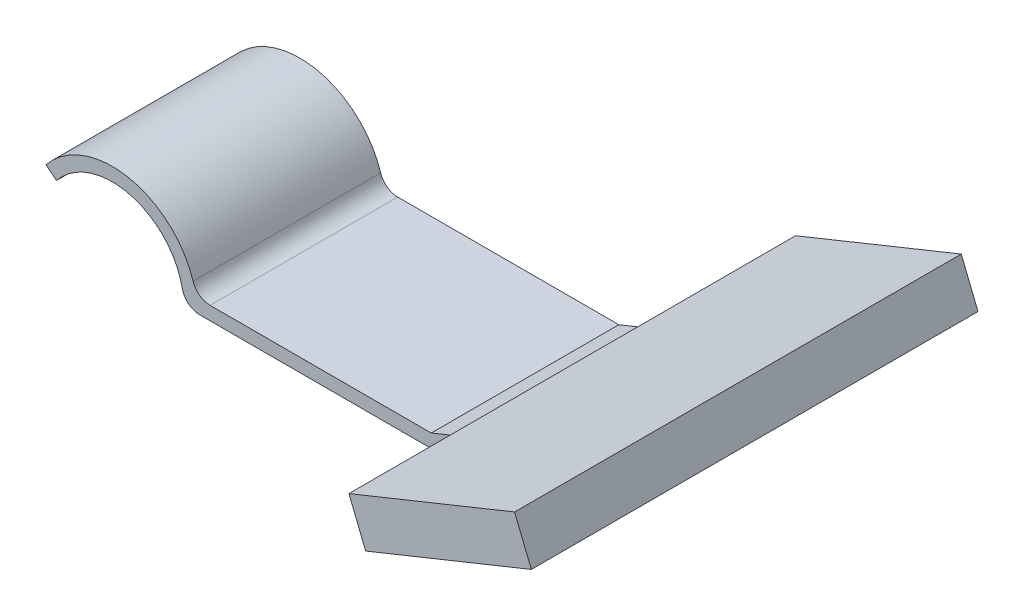
ISO-10303-21;
HEADER;
FILE_DESCRIPTION(('STEP AP214'),'2;1');
FILE_NAME('part.step','',(''),(''),'','','');
FILE_SCHEMA(('AUTOMOTIVE_DESIGN { 1 0 10303 214 1 1 1 1 }'));
ENDSEC;
DATA;
#1=APPLICATION_CONTEXT('core data for automotive mechanical design processes');
#2=APPLICATION_PROTOCOL_DEFINITION('international standard','automotive_design',2000,#1);
#3=PRODUCT_CONTEXT('',#1,'mechanical');
#4=PRODUCT('Part','Part','',(#3));
#5=PRODUCT_RELATED_PRODUCT_CATEGORY('part','',(#4));
#6=PRODUCT_DEFINITION_FORMATION('','',#4);
#7=PRODUCT_DEFINITION_CONTEXT('part definition',#1,'design');
#8=PRODUCT_DEFINITION('design','',#6,#7);
#9=PRODUCT_DEFINITION_SHAPE('','',#8);
#10=(LENGTH_UNIT() NAMED_UNIT(*) SI_UNIT(.MILLI.,.METRE.));
#11=(NAMED_UNIT(*) PLANE_ANGLE_UNIT() SI_UNIT($,.RADIAN.));
#12=(NAMED_UNIT(*) SI_UNIT($,.STERADIAN.) SOLID_ANGLE_UNIT());
#13=UNCERTAINTY_MEASURE_WITH_UNIT(LENGTH_MEASURE(1.E-05),#10,'distance_accuracy_value','');
#14=(GEOMETRIC_REPRESENTATION_CONTEXT(3) GLOBAL_UNCERTAINTY_ASSIGNED_CONTEXT((#13)) GLOBAL_UNIT_ASSIGNED_CONTEXT((#10,
#11,#12)) REPRESENTATION_CONTEXT('',''));
#15=CARTESIAN_POINT('',(0.,0.,0.));
#16=DIRECTION('',(0.,0.,1.));
#17=DIRECTION('',(1.,0.,0.));
#18=AXIS2_PLACEMENT_3D('',#15,#16,#17);
#19=CARTESIAN_POINT('',(28.,0.,10.5));
#20=DIRECTION('',(0.374552819216062,-0.927205578939914,0.));
#21=DIRECTION('',(0.927205578939914,0.374552819216062,0.));
#22=AXIS2_PLACEMENT_3D('',#19,#20,#21);
#23=PLANE('',#22);
#24=DIRECTION('',(-0.927205578939914,-0.374552819216062,0.));
#25=VECTOR('',#24,1.);
#26=CARTESIAN_POINT('',(28.,0.,-10.5));
#27=LINE('',#26,#25);
#28=CARTESIAN_POINT('',(34.2108904228034,2.5089436156788,-10.5));
#29=VERTEX_POINT('',#28);
#30=CARTESIAN_POINT('',(28.,0.,-10.5));
#31=VERTEX_POINT('',#30);
#32=EDGE_CURVE('E216',#29,#31,#27,.T.);
#33=ORIENTED_EDGE('',*,*,#32,.F.);
#34=DIRECTION('',(0.,0.,1.));
#35=VECTOR('',#34,1.);
#36=CARTESIAN_POINT('',(34.2108904228034,2.5089436156788,10.5));
#37=LINE('',#36,#35);
#38=CARTESIAN_POINT('',(34.2108904228034,2.5089436156788,10.5));
#39=VERTEX_POINT('',#38);
#40=EDGE_CURVE('E61',#29,#39,#37,.T.);
#41=ORIENTED_EDGE('',*,*,#40,.T.);
#42=DIRECTION('',(-0.927205578939914,-0.374552819216062,0.));
#43=VECTOR('',#42,1.);
#44=CARTESIAN_POINT('',(28.,0.,10.5));
#45=LINE('',#44,#43);
#46=CARTESIAN_POINT('',(28.,0.,10.5));
#47=VERTEX_POINT('',#46);
#48=EDGE_CURVE('E199',#39,#47,#45,.T.);
#49=ORIENTED_EDGE('',*,*,#48,.T.);
#50=DIRECTION('',(0.,0.,-1.));
#51=VECTOR('',#50,1.);
#52=CARTESIAN_POINT('',(28.,0.,10.5));
#53=LINE('',#52,#51);
#54=EDGE_CURVE('E224',#47,#31,#53,.T.);
#55=ORIENTED_EDGE('',*,*,#54,.T.);
#56=EDGE_LOOP('',(#33,#41,#49,#55));
#57=FACE_BOUND('',#56,.T.);
#58=ADVANCED_FACE('F38',(#57),#23,.T.);
#59=CARTESIAN_POINT('',(27.4381707711759,1.39080836840987,10.5));
#60=DIRECTION('',(0.374552819216062,-0.927205578939913,0.));
#61=DIRECTION('',(0.927205578939914,0.374552819216062,0.));
#62=AXIS2_PLACEMENT_3D('',#59,#60,#61);
#63=PLANE('',#62);
#64=DIRECTION('',(0.,0.,1.));
#65=VECTOR('',#64,1.);
#66=CARTESIAN_POINT('',(33.6490611939793,3.89975198408867,10.5));
#67=LINE('',#66,#65);
#68=CARTESIAN_POINT('',(33.6490611939793,3.89975198408867,-10.5));
#69=VERTEX_POINT('',#68);
#70=CARTESIAN_POINT('',(33.6490611939793,3.89975198408867,10.5));
#71=VERTEX_POINT('',#70);
#72=EDGE_CURVE('E179',#69,#71,#67,.T.);
#73=ORIENTED_EDGE('',*,*,#72,.F.);
#74=DIRECTION('',(-0.927205578939914,-0.374552819216062,0.));
#75=VECTOR('',#74,1.);
#76=CARTESIAN_POINT('',(27.4381707711759,1.39080836840987,-10.5));
#77=LINE('',#76,#75);
#78=CARTESIAN_POINT('',(27.7084746770331,1.5,-10.5));
#79=VERTEX_POINT('',#78);
#80=EDGE_CURVE('E218',#69,#79,#77,.T.);
#81=ORIENTED_EDGE('',*,*,#80,.T.);
#82=DIRECTION('',(0.,0.,-1.));
#83=VECTOR('',#82,1.);
#84=CARTESIAN_POINT('',(27.7084746770331,1.5,10.5));
#85=LINE('',#84,#83);
#86=CARTESIAN_POINT('',(27.7084746770331,1.5,10.5));
#87=VERTEX_POINT('',#86);
#88=EDGE_CURVE('E206',#87,#79,#85,.T.);
#89=ORIENTED_EDGE('',*,*,#88,.F.);
#90=DIRECTION('',(-0.927205578939914,-0.374552819216062,0.));
#91=VECTOR('',#90,1.);
#92=CARTESIAN_POINT('',(27.4381707711759,1.39080836840987,10.5));
#93=LINE('',#92,#91);
#94=EDGE_CURVE('E201',#71,#87,#93,.T.);
#95=ORIENTED_EDGE('',*,*,#94,.F.);
#96=EDGE_LOOP('',(#73,#81,#89,#95));
#97=FACE_BOUND('',#96,.T.);
#98=ADVANCED_FACE('F268',(#97),#63,.F.);
#99=CARTESIAN_POINT('',(-8.,0.,10.5));
#100=DIRECTION('',(0.,0.,1.));
#101=DIRECTION('',(1.,0.,0.));
#102=AXIS2_PLACEMENT_3D('',#99,#100,#101);
#103=PLANE('',#102);
#104=ORIENTED_EDGE('',*,*,#48,.F.);
#105=DIRECTION('',(-0.374552819216062,0.927205578939913,0.));
#106=VECTOR('',#105,1.);
#107=CARTESIAN_POINT('',(29.1604571050262,15.0112923047318,10.5));
#108=LINE('',#107,#106);
#109=EDGE_CURVE('E53',#39,#71,#108,.T.);
#110=ORIENTED_EDGE('',*,*,#109,.T.);
#111=ORIENTED_EDGE('',*,*,#94,.T.);
#112=DIRECTION('',(1.,0.,0.));
#113=VECTOR('',#112,1.);
#114=CARTESIAN_POINT('',(0.,1.5,10.5));
#115=LINE('',#114,#113);
#116=CARTESIAN_POINT('',(2.95445115010332,1.5,10.5));
#117=VERTEX_POINT('',#116);
#118=EDGE_CURVE('E203',#87,#117,#115,.F.);
#119=ORIENTED_EDGE('',*,*,#118,.T.);
#120=CARTESIAN_POINT('',(2.95445115010332,3.5,10.5));
#121=DIRECTION('',(0.,0.,1.));
#122=DIRECTION('',(1.,0.,0.));
#123=AXIS2_PLACEMENT_3D('',#120,#121,#122);
#124=CIRCLE('',#123,2.);
#125=CARTESIAN_POINT('',(1.04932921095492,2.89130434782609,10.5));
#126=VERTEX_POINT('',#125);
#127=EDGE_CURVE('E46',#117,#126,#124,.F.);
#128=ORIENTED_EDGE('',*,*,#127,.T.);
#129=CARTESIAN_POINT('',(-8.,0.,10.5));
#130=DIRECTION('',(0.,0.,1.));
#131=DIRECTION('',(1.,0.,0.));
#132=AXIS2_PLACEMENT_3D('',#129,#130,#131);
#133=CIRCLE('',#132,9.5);
#134=CARTESIAN_POINT('',(-15.4159351230981,5.9375,10.5));
#135=VERTEX_POINT('',#134);
#136=EDGE_CURVE('E188',#126,#135,#133,.T.);
#137=ORIENTED_EDGE('',*,*,#136,.T.);
#138=DIRECTION('',(-0.7806247497998,0.625,0.));
#139=VECTOR('',#138,1.);
#140=CARTESIAN_POINT('',(-14.2449979983984,5.,10.5));
#141=LINE('',#140,#139);
#142=CARTESIAN_POINT('',(-14.2449979983984,5.,10.5));
#143=VERTEX_POINT('',#142);
#144=EDGE_CURVE('E190',#143,#135,#141,.T.);
#145=ORIENTED_EDGE('',*,*,#144,.F.);
#146=CARTESIAN_POINT('',(-8.,0.,10.5));
#147=DIRECTION('',(0.,0.,1.));
#148=DIRECTION('',(1.,0.,0.));
#149=AXIS2_PLACEMENT_3D('',#146,#147,#148);
#150=CIRCLE('',#149,8.);
#151=CARTESIAN_POINT('',(-0.161632823093828,1.6,10.5));
#152=VERTEX_POINT('',#151);
#153=EDGE_CURVE('E194',#152,#143,#150,.T.);
#154=ORIENTED_EDGE('',*,*,#153,.F.);
#155=CARTESIAN_POINT('',(1.79795897113271,2.,10.5));
#156=DIRECTION('',(0.,0.,1.));
#157=DIRECTION('',(1.,0.,0.));
#158=AXIS2_PLACEMENT_3D('',#155,#156,#157);
#159=CIRCLE('',#158,2.);
#160=CARTESIAN_POINT('',(1.79795897113271,0.,10.5));
#161=VERTEX_POINT('',#160);
#162=EDGE_CURVE('E240',#152,#161,#159,.T.);
#163=ORIENTED_EDGE('',*,*,#162,.T.);
#164=DIRECTION('',(-1.,0.,0.));
#165=VECTOR('',#164,1.);
#166=CARTESIAN_POINT('',(0.,0.,10.5));
#167=LINE('',#166,#165);
#168=EDGE_CURVE('E196',#47,#161,#167,.T.);
#169=ORIENTED_EDGE('',*,*,#168,.F.);
#170=EDGE_LOOP('',(#104,#110,#111,#119,#128,#137,#145,#154,#163,#169));
#171=FACE_BOUND('',#170,.T.);
#172=ADVANCED_FACE('F250',(#171),#103,.T.);
#173=CARTESIAN_POINT('',(-8.,0.,-10.5));
#174=DIRECTION('',(0.,0.,1.));
#175=DIRECTION('',(1.,0.,0.));
#176=AXIS2_PLACEMENT_3D('',#173,#174,#175);
#177=PLANE('',#176);
#178=DIRECTION('',(-0.374552819216062,0.927205578939913,0.));
#179=VECTOR('',#178,1.);
#180=CARTESIAN_POINT('',(29.1604571050262,15.0112923047318,-10.5));
#181=LINE('',#180,#179);
#182=EDGE_CURVE('E11',#29,#69,#181,.T.);
#183=ORIENTED_EDGE('',*,*,#182,.F.);
#184=ORIENTED_EDGE('',*,*,#32,.T.);
#185=DIRECTION('',(-1.,0.,0.));
#186=VECTOR('',#185,1.);
#187=CARTESIAN_POINT('',(0.,0.,-10.5));
#188=LINE('',#187,#186);
#189=CARTESIAN_POINT('',(1.79795897113271,0.,-10.5));
#190=VERTEX_POINT('',#189);
#191=EDGE_CURVE('E213',#31,#190,#188,.T.);
#192=ORIENTED_EDGE('',*,*,#191,.T.);
#193=CARTESIAN_POINT('',(1.79795897113271,2.,-10.5));
#194=DIRECTION('',(0.,0.,1.));
#195=DIRECTION('',(1.,0.,0.));
#196=AXIS2_PLACEMENT_3D('',#193,#194,#195);
#197=CIRCLE('',#196,2.);
#198=CARTESIAN_POINT('',(-0.161632823093828,1.6,-10.5));
#199=VERTEX_POINT('',#198);
#200=EDGE_CURVE('E236',#190,#199,#197,.F.);
#201=ORIENTED_EDGE('',*,*,#200,.T.);
#202=CARTESIAN_POINT('',(-8.,0.,-10.5));
#203=DIRECTION('',(0.,0.,1.));
#204=DIRECTION('',(1.,0.,0.));
#205=AXIS2_PLACEMENT_3D('',#202,#203,#204);
#206=CIRCLE('',#205,8.);
#207=CARTESIAN_POINT('',(-14.2449979983984,5.,-10.5));
#208=VERTEX_POINT('',#207);
#209=EDGE_CURVE('E211',#199,#208,#206,.T.);
#210=ORIENTED_EDGE('',*,*,#209,.T.);
#211=DIRECTION('',(-0.7806247497998,0.625,0.));
#212=VECTOR('',#211,1.);
#213=CARTESIAN_POINT('',(-14.2449979983984,5.,-10.5));
#214=LINE('',#213,#212);
#215=CARTESIAN_POINT('',(-15.4159351230981,5.9375,-10.5));
#216=VERTEX_POINT('',#215);
#217=EDGE_CURVE('E208',#208,#216,#214,.T.);
#218=ORIENTED_EDGE('',*,*,#217,.T.);
#219=CARTESIAN_POINT('',(-8.,0.,-10.5));
#220=DIRECTION('',(0.,0.,1.));
#221=DIRECTION('',(1.,0.,0.));
#222=AXIS2_PLACEMENT_3D('',#219,#220,#221);
#223=CIRCLE('',#222,9.5);
#224=CARTESIAN_POINT('',(1.04932921095492,2.89130434782609,-10.5));
#225=VERTEX_POINT('',#224);
#226=EDGE_CURVE('E187',#225,#216,#223,.T.);
#227=ORIENTED_EDGE('',*,*,#226,.F.);
#228=CARTESIAN_POINT('',(2.95445115010332,3.5,-10.5));
#229=DIRECTION('',(0.,0.,1.));
#230=DIRECTION('',(1.,0.,0.));
#231=AXIS2_PLACEMENT_3D('',#228,#229,#230);
#232=CIRCLE('',#231,2.);
#233=CARTESIAN_POINT('',(2.95445115010332,1.5,-10.5));
#234=VERTEX_POINT('',#233);
#235=EDGE_CURVE('E247',#225,#234,#232,.T.);
#236=ORIENTED_EDGE('',*,*,#235,.T.);
#237=DIRECTION('',(1.,0.,0.));
#238=VECTOR('',#237,1.);
#239=CARTESIAN_POINT('',(0.,1.5,-10.5));
#240=LINE('',#239,#238);
#241=EDGE_CURVE('E191',#79,#234,#240,.F.);
#242=ORIENTED_EDGE('',*,*,#241,.F.);
#243=ORIENTED_EDGE('',*,*,#80,.F.);
#244=EDGE_LOOP('',(#183,#184,#192,#201,#210,#218,#227,#236,#242,#243));
#245=FACE_BOUND('',#244,.T.);
#246=ADVANCED_FACE('F262',(#245),#177,.F.);
#247=CARTESIAN_POINT('',(-8.,0.,10.5));
#248=DIRECTION('',(0.,0.,-1.));
#249=DIRECTION('',(-1.,0.,0.));
#250=AXIS2_PLACEMENT_3D('',#247,#248,#249);
#251=CYLINDRICAL_SURFACE('',#250,9.5);
#252=ORIENTED_EDGE('',*,*,#136,.F.);
#253=DIRECTION('',(0.,0.,-1.));
#254=VECTOR('',#253,1.);
#255=CARTESIAN_POINT('',(1.04932921095492,2.89130434782609,10.5));
#256=LINE('',#255,#254);
#257=EDGE_CURVE('E242',#126,#225,#256,.T.);
#258=ORIENTED_EDGE('',*,*,#257,.T.);
#259=ORIENTED_EDGE('',*,*,#226,.T.);
#260=DIRECTION('',(0.,0.,-1.));
#261=VECTOR('',#260,1.);
#262=CARTESIAN_POINT('',(-15.4159351230981,5.9375,10.5));
#263=LINE('',#262,#261);
#264=EDGE_CURVE('E230',#135,#216,#263,.T.);
#265=ORIENTED_EDGE('',*,*,#264,.F.);
#266=EDGE_LOOP('',(#252,#258,#259,#265));
#267=FACE_BOUND('',#266,.T.);
#268=ADVANCED_FACE('F258',(#267),#251,.T.);
#269=CARTESIAN_POINT('',(-14.2449979983984,5.,10.5));
#270=DIRECTION('',(-0.625,-0.780624749799799,0.));
#271=DIRECTION('',(0.7806247497998,-0.625,0.));
#272=AXIS2_PLACEMENT_3D('',#269,#270,#271);
#273=PLANE('',#272);
#274=ORIENTED_EDGE('',*,*,#217,.F.);
#275=DIRECTION('',(0.,0.,-1.));
#276=VECTOR('',#275,1.);
#277=CARTESIAN_POINT('',(-14.2449979983984,5.,10.5));
#278=LINE('',#277,#276);
#279=EDGE_CURVE('E227',#143,#208,#278,.T.);
#280=ORIENTED_EDGE('',*,*,#279,.F.);
#281=ORIENTED_EDGE('',*,*,#144,.T.);
#282=ORIENTED_EDGE('',*,*,#264,.T.);
#283=EDGE_LOOP('',(#274,#280,#281,#282));
#284=FACE_BOUND('',#283,.T.);
#285=ADVANCED_FACE('F298',(#284),#273,.T.);
#286=CARTESIAN_POINT('',(-8.,0.,10.5));
#287=DIRECTION('',(0.,0.,-1.));
#288=DIRECTION('',(-1.,0.,0.));
#289=AXIS2_PLACEMENT_3D('',#286,#287,#288);
#290=CYLINDRICAL_SURFACE('',#289,8.);
#291=ORIENTED_EDGE('',*,*,#209,.F.);
#292=DIRECTION('',(0.,0.,-1.));
#293=VECTOR('',#292,1.);
#294=CARTESIAN_POINT('',(-0.161632823093828,1.6,10.5));
#295=LINE('',#294,#293);
#296=EDGE_CURVE('E238',#199,#152,#295,.F.);
#297=ORIENTED_EDGE('',*,*,#296,.T.);
#298=ORIENTED_EDGE('',*,*,#153,.T.);
#299=ORIENTED_EDGE('',*,*,#279,.T.);
#300=EDGE_LOOP('',(#291,#297,#298,#299));
#301=FACE_BOUND('',#300,.T.);
#302=ADVANCED_FACE('F294',(#301),#290,.F.);
#303=CARTESIAN_POINT('',(0.,0.,10.5));
#304=DIRECTION('',(0.,-1.,0.));
#305=DIRECTION('',(0.,0.,-1.));
#306=AXIS2_PLACEMENT_3D('',#303,#304,#305);
#307=PLANE('',#306);
#308=ORIENTED_EDGE('',*,*,#168,.T.);
#309=DIRECTION('',(0.,0.,-1.));
#310=VECTOR('',#309,1.);
#311=CARTESIAN_POINT('',(1.79795897113271,0.,10.5));
#312=LINE('',#311,#310);
#313=EDGE_CURVE('E233',#161,#190,#312,.T.);
#314=ORIENTED_EDGE('',*,*,#313,.T.);
#315=ORIENTED_EDGE('',*,*,#191,.F.);
#316=ORIENTED_EDGE('',*,*,#54,.F.);
#317=EDGE_LOOP('',(#308,#314,#315,#316));
#318=FACE_BOUND('',#317,.T.);
#319=ADVANCED_FACE('F291',(#318),#307,.T.);
#320=CARTESIAN_POINT('',(0.,1.5,10.5));
#321=DIRECTION('',(0.,-1.,0.));
#322=DIRECTION('',(0.,0.,-1.));
#323=AXIS2_PLACEMENT_3D('',#320,#321,#322);
#324=PLANE('',#323);
#325=ORIENTED_EDGE('',*,*,#241,.T.);
#326=DIRECTION('',(0.,0.,1.));
#327=VECTOR('',#326,1.);
#328=CARTESIAN_POINT('',(2.95445115010332,1.5,10.5));
#329=LINE('',#328,#327);
#330=EDGE_CURVE('E245',#234,#117,#329,.T.);
#331=ORIENTED_EDGE('',*,*,#330,.T.);
#332=ORIENTED_EDGE('',*,*,#118,.F.);
#333=ORIENTED_EDGE('',*,*,#88,.T.);
#334=EDGE_LOOP('',(#325,#331,#332,#333));
#335=FACE_BOUND('',#334,.T.);
#336=ADVANCED_FACE('F264',(#335),#324,.F.);
#337=CARTESIAN_POINT('',(1.79795897113271,2.,10.5));
#338=DIRECTION('',(0.,0.,-1.));
#339=DIRECTION('',(-1.,0.,0.));
#340=AXIS2_PLACEMENT_3D('',#337,#338,#339);
#341=CYLINDRICAL_SURFACE('',#340,2.);
#342=ORIENTED_EDGE('',*,*,#162,.F.);
#343=ORIENTED_EDGE('',*,*,#296,.F.);
#344=ORIENTED_EDGE('',*,*,#200,.F.);
#345=ORIENTED_EDGE('',*,*,#313,.F.);
#346=EDGE_LOOP('',(#342,#343,#344,#345));
#347=FACE_BOUND('',#346,.T.);
#348=ADVANCED_FACE('F304',(#347),#341,.T.);
#349=CARTESIAN_POINT('',(2.95445115010332,3.5,10.5));
#350=DIRECTION('',(0.,0.,-1.));
#351=DIRECTION('',(-1.,0.,0.));
#352=AXIS2_PLACEMENT_3D('',#349,#350,#351);
#353=CYLINDRICAL_SURFACE('',#352,2.);
#354=ORIENTED_EDGE('',*,*,#127,.F.);
#355=ORIENTED_EDGE('',*,*,#330,.F.);
#356=ORIENTED_EDGE('',*,*,#235,.F.);
#357=ORIENTED_EDGE('',*,*,#257,.F.);
#358=EDGE_LOOP('',(#354,#355,#356,#357));
#359=FACE_BOUND('',#358,.T.);
#360=ADVANCED_FACE('F40',(#359),#353,.F.);
#361=CARTESIAN_POINT('',(34.8663578564316,0.886333852533787,25.));
#362=DIRECTION('',(0.,0.,1.));
#363=DIRECTION('',(1.,0.,0.));
#364=AXIS2_PLACEMENT_3D('',#361,#362,#363);
#365=PLANE('',#364);
#366=DIRECTION('',(0.374552819216062,-0.927205578939913,0.));
#367=VECTOR('',#366,1.);
#368=CARTESIAN_POINT('',(53.4104694352298,8.37739023685503,25.));
#369=LINE('',#368,#367);
#370=CARTESIAN_POINT('',(51.5377053391495,13.0134181315546,25.));
#371=VERTEX_POINT('',#370);
#372=CARTESIAN_POINT('',(53.4104694352298,8.37739023685503,25.));
#373=VERTEX_POINT('',#372);
#374=EDGE_CURVE('E173',#371,#373,#369,.T.);
#375=ORIENTED_EDGE('',*,*,#374,.F.);
#376=DIRECTION('',(0.927205578939913,0.374552819216062,0.));
#377=VECTOR('',#376,1.);
#378=CARTESIAN_POINT('',(32.9935937603513,5.52236174723335,25.));
#379=LINE('',#378,#377);
#380=CARTESIAN_POINT('',(32.9935937603513,5.52236174723335,25.));
#381=VERTEX_POINT('',#380);
#382=EDGE_CURVE('E164',#381,#371,#379,.T.);
#383=ORIENTED_EDGE('',*,*,#382,.F.);
#384=DIRECTION('',(0.374552819216062,-0.927205578939913,0.));
#385=VECTOR('',#384,1.);
#386=CARTESIAN_POINT('',(34.8663578564316,0.886333852533787,25.));
#387=LINE('',#386,#385);
#388=CARTESIAN_POINT('',(34.8663578564316,0.886333852533787,25.));
#389=VERTEX_POINT('',#388);
#390=EDGE_CURVE('E158',#381,#389,#387,.T.);
#391=ORIENTED_EDGE('',*,*,#390,.T.);
#392=DIRECTION('',(0.927205578939913,0.374552819216062,0.));
#393=VECTOR('',#392,1.);
#394=CARTESIAN_POINT('',(34.8663578564316,0.886333852533787,25.));
#395=LINE('',#394,#393);
#396=EDGE_CURVE('E140',#389,#373,#395,.T.);
#397=ORIENTED_EDGE('',*,*,#396,.T.);
#398=EDGE_LOOP('',(#375,#383,#391,#397));
#399=FACE_BOUND('',#398,.T.);
#400=ADVANCED_FACE('F163',(#399),#365,.T.);
#401=CARTESIAN_POINT('',(32.9935937603513,5.52236174723336,-25.));
#402=DIRECTION('',(-0.374552819216062,0.927205578939913,0.));
#403=DIRECTION('',(-0.927205578939913,-0.374552819216062,0.));
#404=AXIS2_PLACEMENT_3D('',#401,#402,#403);
#405=PLANE('',#404);
#406=DIRECTION('',(0.,0.,1.));
#407=VECTOR('',#406,1.);
#408=CARTESIAN_POINT('',(51.5377053391495,13.0134181315546,-25.));
#409=LINE('',#408,#407);
#410=CARTESIAN_POINT('',(51.5377053391495,13.0134181315546,-25.));
#411=VERTEX_POINT('',#410);
#412=EDGE_CURVE('E165',#411,#371,#409,.T.);
#413=ORIENTED_EDGE('',*,*,#412,.F.);
#414=DIRECTION('',(0.927205578939913,0.374552819216062,0.));
#415=VECTOR('',#414,1.);
#416=CARTESIAN_POINT('',(32.9935937603513,5.52236174723336,-25.));
#417=LINE('',#416,#415);
#418=CARTESIAN_POINT('',(32.9935937603513,5.52236174723336,-25.));
#419=VERTEX_POINT('',#418);
#420=EDGE_CURVE('E180',#419,#411,#417,.T.);
#421=ORIENTED_EDGE('',*,*,#420,.F.);
#422=DIRECTION('',(0.,0.,1.));
#423=VECTOR('',#422,1.);
#424=CARTESIAN_POINT('',(32.9935937603513,5.52236174723336,-25.));
#425=LINE('',#424,#423);
#426=EDGE_CURVE('E151',#419,#381,#425,.T.);
#427=ORIENTED_EDGE('',*,*,#426,.T.);
#428=ORIENTED_EDGE('',*,*,#382,.T.);
#429=EDGE_LOOP('',(#413,#421,#427,#428));
#430=FACE_BOUND('',#429,.T.);
#431=ADVANCED_FACE('F328',(#430),#405,.T.);
#432=CARTESIAN_POINT('',(34.8663578564316,0.886333852533794,-25.));
#433=DIRECTION('',(0.,0.,-1.));
#434=DIRECTION('',(-1.,0.,0.));
#435=AXIS2_PLACEMENT_3D('',#432,#433,#434);
#436=PLANE('',#435);
#437=DIRECTION('',(-0.374552819216062,0.927205578939913,0.));
#438=VECTOR('',#437,1.);
#439=CARTESIAN_POINT('',(53.4104694352298,8.37739023685503,-25.));
#440=LINE('',#439,#438);
#441=CARTESIAN_POINT('',(53.4104694352298,8.37739023685503,-25.));
#442=VERTEX_POINT('',#441);
#443=EDGE_CURVE('E168',#442,#411,#440,.T.);
#444=ORIENTED_EDGE('',*,*,#443,.F.);
#445=DIRECTION('',(0.927205578939913,0.374552819216062,0.));
#446=VECTOR('',#445,1.);
#447=CARTESIAN_POINT('',(34.8663578564316,0.886333852533794,-25.));
#448=LINE('',#447,#446);
#449=CARTESIAN_POINT('',(34.8663578564316,0.886333852533794,-25.));
#450=VERTEX_POINT('',#449);
#451=EDGE_CURVE('E150',#450,#442,#448,.T.);
#452=ORIENTED_EDGE('',*,*,#451,.F.);
#453=DIRECTION('',(-0.374552819216062,0.927205578939913,0.));
#454=VECTOR('',#453,1.);
#455=CARTESIAN_POINT('',(34.8663578564316,0.886333852533794,-25.));
#456=LINE('',#455,#454);
#457=EDGE_CURVE('E161',#450,#419,#456,.T.);
#458=ORIENTED_EDGE('',*,*,#457,.T.);
#459=ORIENTED_EDGE('',*,*,#420,.T.);
#460=EDGE_LOOP('',(#444,#452,#458,#459));
#461=FACE_BOUND('',#460,.T.);
#462=ADVANCED_FACE('F281',(#461),#436,.T.);
#463=CARTESIAN_POINT('',(34.8663578564316,0.886333852533794,-25.));
#464=DIRECTION('',(0.374552819216062,-0.927205578939913,0.));
#465=DIRECTION('',(0.927205578939913,0.374552819216062,0.));
#466=AXIS2_PLACEMENT_3D('',#463,#464,#465);
#467=PLANE('',#466);
#468=DIRECTION('',(0.,0.,-1.));
#469=VECTOR('',#468,1.);
#470=CARTESIAN_POINT('',(53.4104694352298,8.37739023685503,-25.));
#471=LINE('',#470,#469);
#472=EDGE_CURVE('E145',#373,#442,#471,.T.);
#473=ORIENTED_EDGE('',*,*,#472,.F.);
#474=ORIENTED_EDGE('',*,*,#396,.F.);
#475=DIRECTION('',(0.,0.,-1.));
#476=VECTOR('',#475,1.);
#477=CARTESIAN_POINT('',(34.8663578564316,0.886333852533794,-25.));
#478=LINE('',#477,#476);
#479=EDGE_CURVE('E143',#389,#450,#478,.T.);
#480=ORIENTED_EDGE('',*,*,#479,.T.);
#481=ORIENTED_EDGE('',*,*,#451,.T.);
#482=EDGE_LOOP('',(#473,#474,#480,#481));
#483=FACE_BOUND('',#482,.T.);
#484=ADVANCED_FACE('F142',(#483),#467,.T.);
#485=CARTESIAN_POINT('',(30.2827756200878,12.2329925960533,0.));
#486=DIRECTION('',(0.927205578939914,0.374552819216062,0.));
#487=DIRECTION('',(-0.374552819216062,0.927205578939913,0.));
#488=AXIS2_PLACEMENT_3D('',#485,#486,#487);
#489=PLANE('',#488);
#490=ORIENTED_EDGE('',*,*,#109,.F.);
#491=ORIENTED_EDGE('',*,*,#40,.F.);
#492=ORIENTED_EDGE('',*,*,#182,.T.);
#493=ORIENTED_EDGE('',*,*,#72,.T.);
#494=EDGE_LOOP('',(#490,#491,#492,#493));
#495=FACE_BOUND('',#494,.T.);
#496=ORIENTED_EDGE('',*,*,#390,.F.);
#497=ORIENTED_EDGE('',*,*,#426,.F.);
#498=ORIENTED_EDGE('',*,*,#457,.F.);
#499=ORIENTED_EDGE('',*,*,#479,.F.);
#500=EDGE_LOOP('',(#496,#497,#498,#499));
#501=FACE_BOUND('',#500,.T.);
#502=ADVANCED_FACE('F156',(#495,#501),#489,.F.);
#503=CARTESIAN_POINT('',(52.1931727727775,11.3908083684099,10.5));
#504=DIRECTION('',(0.927205578939916,0.374552819216056,0.));
#505=DIRECTION('',(-0.374552819216056,0.927205578939916,0.));
#506=AXIS2_PLACEMENT_3D('',#503,#504,#505);
#507=PLANE('',#506);
#508=ORIENTED_EDGE('',*,*,#374,.T.);
#509=ORIENTED_EDGE('',*,*,#472,.T.);
#510=ORIENTED_EDGE('',*,*,#443,.T.);
#511=ORIENTED_EDGE('',*,*,#412,.T.);
#512=EDGE_LOOP('',(#508,#509,#510,#511));
#513=FACE_BOUND('',#512,.T.);
#514=ADVANCED_FACE('F273',(#513),#507,.T.);
#515=CLOSED_SHELL('',(#58,#98,#172,#246,#268,#285,#302,#319,#336,#348,#360,#400,#431,#462,#484,
#502,#514));
#516=MANIFOLD_SOLID_BREP('B2',#515);
#517=ADVANCED_BREP_SHAPE_REPRESENTATION('',(#18,#516),#14);
#518=SHAPE_DEFINITION_REPRESENTATION(#9,#517);
ENDSEC;
END-ISO-10303-21;
